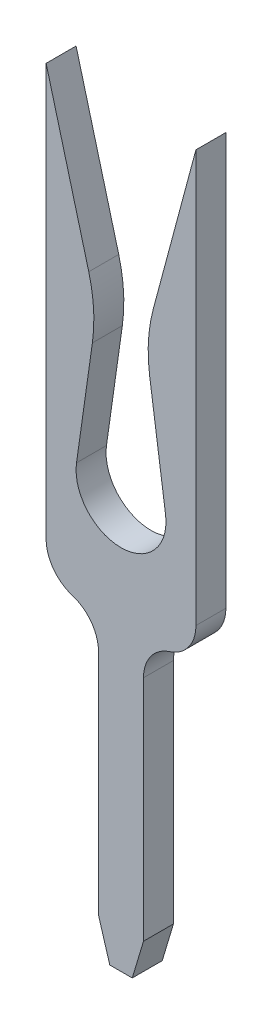
ISO-10303-21;
HEADER;
FILE_DESCRIPTION(('STEP AP214'),'2;1');
FILE_NAME('part.step','',(''),(''),'','','');
FILE_SCHEMA(('AUTOMOTIVE_DESIGN { 1 0 10303 214 1 1 1 1 }'));
ENDSEC;
DATA;
#1=APPLICATION_CONTEXT('core data for automotive mechanical design processes');
#2=APPLICATION_PROTOCOL_DEFINITION('international standard','automotive_design',2000,#1);
#3=PRODUCT_CONTEXT('',#1,'mechanical');
#4=PRODUCT('Part','Part','',(#3));
#5=PRODUCT_RELATED_PRODUCT_CATEGORY('part','',(#4));
#6=PRODUCT_DEFINITION_FORMATION('','',#4);
#7=PRODUCT_DEFINITION_CONTEXT('part definition',#1,'design');
#8=PRODUCT_DEFINITION('design','',#6,#7);
#9=PRODUCT_DEFINITION_SHAPE('','',#8);
#10=(LENGTH_UNIT() NAMED_UNIT(*) SI_UNIT(.MILLI.,.METRE.));
#11=(NAMED_UNIT(*) PLANE_ANGLE_UNIT() SI_UNIT($,.RADIAN.));
#12=(NAMED_UNIT(*) SI_UNIT($,.STERADIAN.) SOLID_ANGLE_UNIT());
#13=UNCERTAINTY_MEASURE_WITH_UNIT(LENGTH_MEASURE(1.E-05),#10,'distance_accuracy_value','');
#14=(GEOMETRIC_REPRESENTATION_CONTEXT(3) GLOBAL_UNCERTAINTY_ASSIGNED_CONTEXT((#13)) GLOBAL_UNIT_ASSIGNED_CONTEXT((#10,
#11,#12)) REPRESENTATION_CONTEXT('',''));
#15=CARTESIAN_POINT('',(0.,0.,0.));
#16=DIRECTION('',(0.,0.,1.));
#17=DIRECTION('',(1.,0.,0.));
#18=AXIS2_PLACEMENT_3D('',#15,#16,#17);
#19=CARTESIAN_POINT('',(0.,0.,0.4));
#20=DIRECTION('',(0.,0.,1.));
#21=DIRECTION('',(1.,0.,0.));
#22=AXIS2_PLACEMENT_3D('',#19,#20,#21);
#23=PLANE('',#22);
#24=DIRECTION('',(0.287347885566345,-0.957826285221151,0.));
#25=VECTOR('',#24,1.);
#26=CARTESIAN_POINT('',(-0.3,-3.5,0.4));
#27=LINE('',#26,#25);
#28=CARTESIAN_POINT('',(-0.299999999999951,-3.49999999999997,0.4));
#29=VERTEX_POINT('',#28);
#30=CARTESIAN_POINT('',(-0.15,-4.,0.4));
#31=VERTEX_POINT('',#30);
#32=EDGE_CURVE('E192',#29,#31,#27,.T.);
#33=ORIENTED_EDGE('',*,*,#32,.T.);
#34=DIRECTION('',(1.,0.,0.));
#35=VECTOR('',#34,1.);
#36=CARTESIAN_POINT('',(0.,-4.,0.4));
#37=LINE('',#36,#35);
#38=CARTESIAN_POINT('',(0.15,-4.,0.4));
#39=VERTEX_POINT('',#38);
#40=EDGE_CURVE('E182',#31,#39,#37,.T.);
#41=ORIENTED_EDGE('',*,*,#40,.T.);
#42=DIRECTION('',(0.28734788556607,0.957826285221234,0.));
#43=VECTOR('',#42,1.);
#44=CARTESIAN_POINT('',(0.15,-4.,0.4));
#45=LINE('',#44,#43);
#46=CARTESIAN_POINT('',(0.299999999999952,-3.49999999999999,0.4));
#47=VERTEX_POINT('',#46);
#48=EDGE_CURVE('E166',#47,#39,#45,.F.);
#49=ORIENTED_EDGE('',*,*,#48,.F.);
#50=DIRECTION('',(0.,1.,0.));
#51=VECTOR('',#50,1.);
#52=CARTESIAN_POINT('',(0.3,-3.5,0.4));
#53=LINE('',#52,#51);
#54=CARTESIAN_POINT('',(0.3,-0.453939201417,0.4));
#55=VERTEX_POINT('',#54);
#56=EDGE_CURVE('E143',#55,#47,#53,.F.);
#57=ORIENTED_EDGE('',*,*,#56,.F.);
#58=CARTESIAN_POINT('',(0.8,-0.453939201417,0.4));
#59=DIRECTION('',(0.,0.,1.));
#60=DIRECTION('',(1.,0.,0.));
#61=AXIS2_PLACEMENT_3D('',#58,#59,#60);
#62=CIRCLE('',#61,0.5);
#63=CARTESIAN_POINT('',(0.65,0.0230303992915,0.4));
#64=VERTEX_POINT('',#63);
#65=EDGE_CURVE('E135',#55,#64,#62,.F.);
#66=ORIENTED_EDGE('',*,*,#65,.T.);
#67=CARTESIAN_POINT('',(0.5,0.5,0.4));
#68=DIRECTION('',(0.,0.,1.));
#69=DIRECTION('',(1.,0.,0.));
#70=AXIS2_PLACEMENT_3D('',#67,#68,#69);
#71=CIRCLE('',#70,0.5);
#72=CARTESIAN_POINT('',(1.,0.5,0.4));
#73=VERTEX_POINT('',#72);
#74=EDGE_CURVE('E140',#73,#64,#71,.F.);
#75=ORIENTED_EDGE('',*,*,#74,.F.);
#76=DIRECTION('',(0.,1.,0.));
#77=VECTOR('',#76,1.);
#78=CARTESIAN_POINT('',(1.,0.5,0.4));
#79=LINE('',#78,#77);
#80=CARTESIAN_POINT('',(1.,6.,0.4));
#81=VERTEX_POINT('',#80);
#82=EDGE_CURVE('E224',#81,#73,#79,.F.);
#83=ORIENTED_EDGE('',*,*,#82,.F.);
#84=DIRECTION('',(-0.258819045102985,-0.965925826288944,0.));
#85=VECTOR('',#84,1.);
#86=CARTESIAN_POINT('',(1.,6.,0.4));
#87=LINE('',#86,#85);
#88=CARTESIAN_POINT('',(0.430598100772251,3.8749631821632,0.4));
#89=VERTEX_POINT('',#88);
#90=EDGE_CURVE('E217',#89,#81,#87,.F.);
#91=ORIENTED_EDGE('',*,*,#90,.F.);
#92=CARTESIAN_POINT('',(2.36244975335,3.35732509196,0.4));
#93=DIRECTION('',(0.,0.,1.));
#94=DIRECTION('',(1.,0.,0.));
#95=AXIS2_PLACEMENT_3D('',#92,#93,#94);
#96=CIRCLE('',#95,2.);
#97=CARTESIAN_POINT('',(0.382293985122831,3.07628571118119,0.4));
#98=VERTEX_POINT('',#97);
#99=EDGE_CURVE('E274',#98,#89,#96,.F.);
#100=ORIENTED_EDGE('',*,*,#99,.F.);
#101=DIRECTION('',(0.140519690388954,-0.990077884114675,0.));
#102=VECTOR('',#101,1.);
#103=CARTESIAN_POINT('',(0.382293985123,3.07628571118,0.4));
#104=LINE('',#103,#102);
#105=CARTESIAN_POINT('',(0.594046730468989,1.5843118142317,0.4));
#106=VERTEX_POINT('',#105);
#107=EDGE_CURVE('E212',#106,#98,#104,.F.);
#108=ORIENTED_EDGE('',*,*,#107,.F.);
#109=CARTESIAN_POINT('',(0.,1.5,0.4));
#110=DIRECTION('',(0.,0.,1.));
#111=DIRECTION('',(1.,0.,0.));
#112=AXIS2_PLACEMENT_3D('',#109,#110,#111);
#113=CIRCLE('',#112,0.6);
#114=CARTESIAN_POINT('',(-0.594046730468936,1.58431181423169,0.4));
#115=VERTEX_POINT('',#114);
#116=EDGE_CURVE('E211',#106,#115,#113,.F.);
#117=ORIENTED_EDGE('',*,*,#116,.T.);
#118=DIRECTION('',(-0.140519690388954,-0.990077884114675,0.));
#119=VECTOR('',#118,1.);
#120=CARTESIAN_POINT('',(-0.382293985123,3.07628571118,0.4));
#121=LINE('',#120,#119);
#122=CARTESIAN_POINT('',(-0.382293985121824,3.07628571118105,0.4));
#123=VERTEX_POINT('',#122);
#124=EDGE_CURVE('E208',#115,#123,#121,.F.);
#125=ORIENTED_EDGE('',*,*,#124,.T.);
#126=CARTESIAN_POINT('',(-2.36244975335,3.35732509196,0.4));
#127=DIRECTION('',(0.,0.,1.));
#128=DIRECTION('',(1.,0.,0.));
#129=AXIS2_PLACEMENT_3D('',#126,#127,#128);
#130=CIRCLE('',#129,2.);
#131=CARTESIAN_POINT('',(-0.430598100773073,3.87496318216298,0.4));
#132=VERTEX_POINT('',#131);
#133=EDGE_CURVE('E205',#132,#123,#130,.F.);
#134=ORIENTED_EDGE('',*,*,#133,.F.);
#135=DIRECTION('',(0.258819045102985,-0.965925826288944,0.));
#136=VECTOR('',#135,1.);
#137=CARTESIAN_POINT('',(-1.,6.,0.4));
#138=LINE('',#137,#136);
#139=CARTESIAN_POINT('',(-1.,6.,0.4));
#140=VERTEX_POINT('',#139);
#141=EDGE_CURVE('E202',#132,#140,#138,.F.);
#142=ORIENTED_EDGE('',*,*,#141,.T.);
#143=DIRECTION('',(0.,1.,0.));
#144=VECTOR('',#143,1.);
#145=CARTESIAN_POINT('',(-1.,0.5,0.4));
#146=LINE('',#145,#144);
#147=CARTESIAN_POINT('',(-1.,0.5,0.4));
#148=VERTEX_POINT('',#147);
#149=EDGE_CURVE('E196',#140,#148,#146,.F.);
#150=ORIENTED_EDGE('',*,*,#149,.T.);
#151=CARTESIAN_POINT('',(-0.5,0.5,0.4));
#152=DIRECTION('',(0.,0.,1.));
#153=DIRECTION('',(1.,0.,0.));
#154=AXIS2_PLACEMENT_3D('',#151,#152,#153);
#155=CIRCLE('',#154,0.5);
#156=CARTESIAN_POINT('',(-0.650000000000008,0.0230303992914753,0.4));
#157=VERTEX_POINT('',#156);
#158=EDGE_CURVE('E265',#157,#148,#155,.F.);
#159=ORIENTED_EDGE('',*,*,#158,.F.);
#160=CARTESIAN_POINT('',(-0.8,-0.453939201417,0.4));
#161=DIRECTION('',(0.,0.,1.));
#162=DIRECTION('',(1.,0.,0.));
#163=AXIS2_PLACEMENT_3D('',#160,#161,#162);
#164=CIRCLE('',#163,0.5);
#165=CARTESIAN_POINT('',(-0.3,-0.453939201417,0.4));
#166=VERTEX_POINT('',#165);
#167=EDGE_CURVE('E262',#157,#166,#164,.F.);
#168=ORIENTED_EDGE('',*,*,#167,.T.);
#169=DIRECTION('',(0.,1.,0.));
#170=VECTOR('',#169,1.);
#171=CARTESIAN_POINT('',(-0.3,-3.5,0.4));
#172=LINE('',#171,#170);
#173=EDGE_CURVE('E185',#166,#29,#172,.F.);
#174=ORIENTED_EDGE('',*,*,#173,.T.);
#175=EDGE_LOOP('',(#33,#41,#49,#57,#66,#75,#83,#91,#100,#108,#117,#125,#134,#142,#150,#159,#168,#174));
#176=FACE_BOUND('',#175,.T.);
#177=ADVANCED_FACE('F16',(#176),#23,.T.);
#178=CARTESIAN_POINT('',(0.15,-4.,0.));
#179=DIRECTION('',(0.957826285221234,-0.28734788556607,0.));
#180=DIRECTION('',(0.28734788556607,0.957826285221234,0.));
#181=AXIS2_PLACEMENT_3D('',#178,#179,#180);
#182=PLANE('',#181);
#183=DIRECTION('',(0.,0.,-1.));
#184=VECTOR('',#183,1.);
#185=CARTESIAN_POINT('',(0.3,-3.5,0.));
#186=LINE('',#185,#184);
#187=CARTESIAN_POINT('',(0.3,-3.5,0.));
#188=VERTEX_POINT('',#187);
#189=EDGE_CURVE('E164',#47,#188,#186,.T.);
#190=ORIENTED_EDGE('',*,*,#189,.F.);
#191=ORIENTED_EDGE('',*,*,#48,.T.);
#192=DIRECTION('',(0.,0.,-1.));
#193=VECTOR('',#192,1.);
#194=CARTESIAN_POINT('',(0.15,-4.,0.));
#195=LINE('',#194,#193);
#196=CARTESIAN_POINT('',(0.15,-4.,0.));
#197=VERTEX_POINT('',#196);
#198=EDGE_CURVE('E173',#197,#39,#195,.F.);
#199=ORIENTED_EDGE('',*,*,#198,.F.);
#200=DIRECTION('',(0.287347885566345,0.957826285221151,0.));
#201=VECTOR('',#200,1.);
#202=CARTESIAN_POINT('',(0.15,-4.,0.));
#203=LINE('',#202,#201);
#204=EDGE_CURVE('E169',#197,#188,#203,.T.);
#205=ORIENTED_EDGE('',*,*,#204,.T.);
#206=EDGE_LOOP('',(#190,#191,#199,#205));
#207=FACE_BOUND('',#206,.T.);
#208=ADVANCED_FACE('F529',(#207),#182,.T.);
#209=CARTESIAN_POINT('',(0.3,-3.5,0.));
#210=DIRECTION('',(1.,0.,0.));
#211=DIRECTION('',(0.,0.,-1.));
#212=AXIS2_PLACEMENT_3D('',#209,#210,#211);
#213=PLANE('',#212);
#214=DIRECTION('',(0.,0.,1.));
#215=VECTOR('',#214,1.);
#216=CARTESIAN_POINT('',(0.3,-0.453939201417,0.2));
#217=LINE('',#216,#215);
#218=CARTESIAN_POINT('',(0.3,-0.453939201417,0.));
#219=VERTEX_POINT('',#218);
#220=EDGE_CURVE('E145',#219,#55,#217,.T.);
#221=ORIENTED_EDGE('',*,*,#220,.T.);
#222=ORIENTED_EDGE('',*,*,#56,.T.);
#223=ORIENTED_EDGE('',*,*,#189,.T.);
#224=DIRECTION('',(0.,1.,0.));
#225=VECTOR('',#224,1.);
#226=CARTESIAN_POINT('',(0.3,0.,0.));
#227=LINE('',#226,#225);
#228=EDGE_CURVE('E172',#188,#219,#227,.T.);
#229=ORIENTED_EDGE('',*,*,#228,.T.);
#230=EDGE_LOOP('',(#221,#222,#223,#229));
#231=FACE_BOUND('',#230,.T.);
#232=ADVANCED_FACE('F520',(#231),#213,.T.);
#233=CARTESIAN_POINT('',(0.8,-0.453939201417,0.2));
#234=DIRECTION('',(0.,0.,1.));
#235=DIRECTION('',(1.,0.,0.));
#236=AXIS2_PLACEMENT_3D('',#233,#234,#235);
#237=CYLINDRICAL_SURFACE('',#236,0.5);
#238=CARTESIAN_POINT('',(0.8,-0.453939201417,0.));
#239=DIRECTION('',(0.,0.,1.));
#240=DIRECTION('',(1.,0.,0.));
#241=AXIS2_PLACEMENT_3D('',#238,#239,#240);
#242=CIRCLE('',#241,0.5);
#243=CARTESIAN_POINT('',(0.649999999999992,0.0230303992915248,0.));
#244=VERTEX_POINT('',#243);
#245=EDGE_CURVE('E158',#219,#244,#242,.F.);
#246=ORIENTED_EDGE('',*,*,#245,.T.);
#247=DIRECTION('',(0.,0.,1.));
#248=VECTOR('',#247,1.);
#249=CARTESIAN_POINT('',(0.649999999999992,0.0230303992915248,0.2));
#250=LINE('',#249,#248);
#251=EDGE_CURVE('E151',#64,#244,#250,.F.);
#252=ORIENTED_EDGE('',*,*,#251,.F.);
#253=ORIENTED_EDGE('',*,*,#65,.F.);
#254=ORIENTED_EDGE('',*,*,#220,.F.);
#255=EDGE_LOOP('',(#246,#252,#253,#254));
#256=FACE_BOUND('',#255,.T.);
#257=ADVANCED_FACE('F156',(#256),#237,.F.);
#258=CARTESIAN_POINT('',(0.5,0.5,0.2));
#259=DIRECTION('',(0.,0.,1.));
#260=DIRECTION('',(1.,0.,0.));
#261=AXIS2_PLACEMENT_3D('',#258,#259,#260);
#262=CYLINDRICAL_SURFACE('',#261,0.5);
#263=DIRECTION('',(0.,0.,-1.));
#264=VECTOR('',#263,1.);
#265=CARTESIAN_POINT('',(1.,0.5,0.));
#266=LINE('',#265,#264);
#267=CARTESIAN_POINT('',(1.,0.5,0.));
#268=VERTEX_POINT('',#267);
#269=EDGE_CURVE('E153',#73,#268,#266,.T.);
#270=ORIENTED_EDGE('',*,*,#269,.F.);
#271=ORIENTED_EDGE('',*,*,#74,.T.);
#272=ORIENTED_EDGE('',*,*,#251,.T.);
#273=CARTESIAN_POINT('',(0.5,0.5,0.));
#274=DIRECTION('',(0.,0.,1.));
#275=DIRECTION('',(1.,0.,0.));
#276=AXIS2_PLACEMENT_3D('',#273,#274,#275);
#277=CIRCLE('',#276,0.5);
#278=EDGE_CURVE('E258',#244,#268,#277,.T.);
#279=ORIENTED_EDGE('',*,*,#278,.T.);
#280=EDGE_LOOP('',(#270,#271,#272,#279));
#281=FACE_BOUND('',#280,.T.);
#282=ADVANCED_FACE('F149',(#281),#262,.T.);
#283=CARTESIAN_POINT('',(1.,0.5,0.));
#284=DIRECTION('',(1.,0.,0.));
#285=DIRECTION('',(0.,0.,-1.));
#286=AXIS2_PLACEMENT_3D('',#283,#284,#285);
#287=PLANE('',#286);
#288=DIRECTION('',(0.,0.,1.));
#289=VECTOR('',#288,1.);
#290=CARTESIAN_POINT('',(1.,6.,0.));
#291=LINE('',#290,#289);
#292=CARTESIAN_POINT('',(1.,6.,0.));
#293=VERTEX_POINT('',#292);
#294=EDGE_CURVE('E221',#81,#293,#291,.F.);
#295=ORIENTED_EDGE('',*,*,#294,.F.);
#296=ORIENTED_EDGE('',*,*,#82,.T.);
#297=ORIENTED_EDGE('',*,*,#269,.T.);
#298=DIRECTION('',(0.,1.,0.));
#299=VECTOR('',#298,1.);
#300=CARTESIAN_POINT('',(1.,0.,0.));
#301=LINE('',#300,#299);
#302=EDGE_CURVE('E260',#268,#293,#301,.T.);
#303=ORIENTED_EDGE('',*,*,#302,.T.);
#304=EDGE_LOOP('',(#295,#296,#297,#303));
#305=FACE_BOUND('',#304,.T.);
#306=ADVANCED_FACE('F297',(#305),#287,.T.);
#307=CARTESIAN_POINT('',(1.,6.,0.));
#308=DIRECTION('',(-0.965925826288944,0.258819045102985,0.));
#309=DIRECTION('',(-0.258819045102985,-0.965925826288944,0.));
#310=AXIS2_PLACEMENT_3D('',#307,#308,#309);
#311=PLANE('',#310);
#312=DIRECTION('',(0.,0.,1.));
#313=VECTOR('',#312,1.);
#314=CARTESIAN_POINT('',(0.430598100770746,3.87496318216087,0.2));
#315=LINE('',#314,#313);
#316=CARTESIAN_POINT('',(0.43059810077286,3.87496318216225,0.));
#317=VERTEX_POINT('',#316);
#318=EDGE_CURVE('E220',#89,#317,#315,.F.);
#319=ORIENTED_EDGE('',*,*,#318,.F.);
#320=ORIENTED_EDGE('',*,*,#90,.T.);
#321=ORIENTED_EDGE('',*,*,#294,.T.);
#322=DIRECTION('',(-0.258819045102253,-0.96592582628914,0.));
#323=VECTOR('',#322,1.);
#324=CARTESIAN_POINT('',(1.,6.,0.));
#325=LINE('',#324,#323);
#326=EDGE_CURVE('E257',#293,#317,#325,.T.);
#327=ORIENTED_EDGE('',*,*,#326,.T.);
#328=EDGE_LOOP('',(#319,#320,#321,#327));
#329=FACE_BOUND('',#328,.T.);
#330=ADVANCED_FACE('F289',(#329),#311,.T.);
#331=CARTESIAN_POINT('',(2.36244975335,3.35732509196,0.2));
#332=DIRECTION('',(0.,0.,1.));
#333=DIRECTION('',(1.,0.,0.));
#334=AXIS2_PLACEMENT_3D('',#331,#332,#333);
#335=CYLINDRICAL_SURFACE('',#334,2.);
#336=DIRECTION('',(0.,0.,1.));
#337=VECTOR('',#336,1.);
#338=CARTESIAN_POINT('',(0.382293985123,3.07628571118,0.));
#339=LINE('',#338,#337);
#340=CARTESIAN_POINT('',(0.382293985122815,3.0762857111813,0.));
#341=VERTEX_POINT('',#340);
#342=EDGE_CURVE('E216',#98,#341,#339,.F.);
#343=ORIENTED_EDGE('',*,*,#342,.F.);
#344=ORIENTED_EDGE('',*,*,#99,.T.);
#345=ORIENTED_EDGE('',*,*,#318,.T.);
#346=CARTESIAN_POINT('',(2.36244975335,3.35732509196,0.));
#347=DIRECTION('',(0.,0.,1.));
#348=DIRECTION('',(1.,0.,0.));
#349=AXIS2_PLACEMENT_3D('',#346,#347,#348);
#350=CIRCLE('',#349,2.);
#351=EDGE_CURVE('E254',#317,#341,#350,.T.);
#352=ORIENTED_EDGE('',*,*,#351,.T.);
#353=EDGE_LOOP('',(#343,#344,#345,#352));
#354=FACE_BOUND('',#353,.T.);
#355=ADVANCED_FACE('F479',(#354),#335,.T.);
#356=CARTESIAN_POINT('',(0.382293985123,3.07628571118,0.));
#357=DIRECTION('',(-0.990077884114675,-0.140519690388954,0.));
#358=DIRECTION('',(0.140519690388954,-0.990077884114675,0.));
#359=AXIS2_PLACEMENT_3D('',#356,#357,#358);
#360=PLANE('',#359);
#361=DIRECTION('',(0.,0.,1.));
#362=VECTOR('',#361,1.);
#363=CARTESIAN_POINT('',(0.594046730469278,1.58431181423004,0.2));
#364=LINE('',#363,#362);
#365=CARTESIAN_POINT('',(0.594046730468908,1.58431181423165,0.));
#366=VERTEX_POINT('',#365);
#367=EDGE_CURVE('E215',#366,#106,#364,.T.);
#368=ORIENTED_EDGE('',*,*,#367,.T.);
#369=ORIENTED_EDGE('',*,*,#107,.T.);
#370=ORIENTED_EDGE('',*,*,#342,.T.);
#371=DIRECTION('',(0.14051969038884,-0.990077884114692,0.));
#372=VECTOR('',#371,1.);
#373=CARTESIAN_POINT('',(0.382293985123,3.07628571118,0.));
#374=LINE('',#373,#372);
#375=EDGE_CURVE('E253',#341,#366,#374,.T.);
#376=ORIENTED_EDGE('',*,*,#375,.T.);
#377=EDGE_LOOP('',(#368,#369,#370,#376));
#378=FACE_BOUND('',#377,.T.);
#379=ADVANCED_FACE('F332',(#378),#360,.T.);
#380=CARTESIAN_POINT('',(0.,1.5,0.2));
#381=DIRECTION('',(0.,0.,1.));
#382=DIRECTION('',(1.,0.,0.));
#383=AXIS2_PLACEMENT_3D('',#380,#381,#382);
#384=CYLINDRICAL_SURFACE('',#383,0.6);
#385=CARTESIAN_POINT('',(0.,1.5,0.));
#386=DIRECTION('',(0.,0.,1.));
#387=DIRECTION('',(1.,0.,0.));
#388=AXIS2_PLACEMENT_3D('',#385,#386,#387);
#389=CIRCLE('',#388,0.6);
#390=CARTESIAN_POINT('',(-0.594046730468854,1.58431181423164,0.));
#391=VERTEX_POINT('',#390);
#392=EDGE_CURVE('E251',#366,#391,#389,.F.);
#393=ORIENTED_EDGE('',*,*,#392,.T.);
#394=DIRECTION('',(0.,0.,1.));
#395=VECTOR('',#394,1.);
#396=CARTESIAN_POINT('',(-0.594046730469172,1.58431181423002,0.));
#397=LINE('',#396,#395);
#398=EDGE_CURVE('E210',#391,#115,#397,.T.);
#399=ORIENTED_EDGE('',*,*,#398,.T.);
#400=ORIENTED_EDGE('',*,*,#116,.F.);
#401=ORIENTED_EDGE('',*,*,#367,.F.);
#402=EDGE_LOOP('',(#393,#399,#400,#401));
#403=FACE_BOUND('',#402,.T.);
#404=ADVANCED_FACE('F336',(#403),#384,.F.);
#405=CARTESIAN_POINT('',(-0.382293985123,3.07628571118,0.));
#406=DIRECTION('',(-0.990077884114675,0.140519690388954,0.));
#407=DIRECTION('',(-0.140519690388954,-0.990077884114675,0.));
#408=AXIS2_PLACEMENT_3D('',#405,#406,#407);
#409=PLANE('',#408);
#410=DIRECTION('',(0.14051969038884,0.990077884114692,0.));
#411=VECTOR('',#410,1.);
#412=CARTESIAN_POINT('',(-0.594046730469,1.58431181423,0.));
#413=LINE('',#412,#411);
#414=CARTESIAN_POINT('',(-0.382293985121808,3.07628571118116,0.));
#415=VERTEX_POINT('',#414);
#416=EDGE_CURVE('E250',#391,#415,#413,.T.);
#417=ORIENTED_EDGE('',*,*,#416,.T.);
#418=DIRECTION('',(0.,0.,1.));
#419=VECTOR('',#418,1.);
#420=CARTESIAN_POINT('',(-0.382293985120986,3.07628571117971,0.2));
#421=LINE('',#420,#419);
#422=EDGE_CURVE('E271',#123,#415,#421,.F.);
#423=ORIENTED_EDGE('',*,*,#422,.F.);
#424=ORIENTED_EDGE('',*,*,#124,.F.);
#425=ORIENTED_EDGE('',*,*,#398,.F.);
#426=EDGE_LOOP('',(#417,#423,#424,#425));
#427=FACE_BOUND('',#426,.T.);
#428=ADVANCED_FACE('F378',(#427),#409,.F.);
#429=CARTESIAN_POINT('',(-2.36244975335,3.35732509196,0.2));
#430=DIRECTION('',(0.,0.,1.));
#431=DIRECTION('',(1.,0.,0.));
#432=AXIS2_PLACEMENT_3D('',#429,#430,#431);
#433=CYLINDRICAL_SURFACE('',#432,2.);
#434=DIRECTION('',(0.,0.,1.));
#435=VECTOR('',#434,1.);
#436=CARTESIAN_POINT('',(-0.43059810077239,3.87496318216043,0.));
#437=LINE('',#436,#435);
#438=CARTESIAN_POINT('',(-0.430598100773682,3.87496318216203,0.));
#439=VERTEX_POINT('',#438);
#440=EDGE_CURVE('E199',#439,#132,#437,.T.);
#441=ORIENTED_EDGE('',*,*,#440,.T.);
#442=ORIENTED_EDGE('',*,*,#133,.T.);
#443=ORIENTED_EDGE('',*,*,#422,.T.);
#444=CARTESIAN_POINT('',(-2.36244975335,3.35732509196,0.));
#445=DIRECTION('',(0.,0.,1.));
#446=DIRECTION('',(1.,0.,0.));
#447=AXIS2_PLACEMENT_3D('',#444,#445,#446);
#448=CIRCLE('',#447,2.);
#449=EDGE_CURVE('E246',#415,#439,#448,.T.);
#450=ORIENTED_EDGE('',*,*,#449,.T.);
#451=EDGE_LOOP('',(#441,#442,#443,#450));
#452=FACE_BOUND('',#451,.T.);
#453=ADVANCED_FACE('F377',(#452),#433,.T.);
#454=CARTESIAN_POINT('',(-1.,6.,0.));
#455=DIRECTION('',(-0.965925826288944,-0.258819045102985,0.));
#456=DIRECTION('',(0.258819045102985,-0.965925826288944,0.));
#457=AXIS2_PLACEMENT_3D('',#454,#455,#456);
#458=PLANE('',#457);
#459=DIRECTION('',(-0.258819045102253,0.96592582628914,0.));
#460=VECTOR('',#459,1.);
#461=CARTESIAN_POINT('',(-0.430598100774,3.87496318216,0.));
#462=LINE('',#461,#460);
#463=CARTESIAN_POINT('',(-1.,6.,0.));
#464=VERTEX_POINT('',#463);
#465=EDGE_CURVE('E249',#439,#464,#462,.T.);
#466=ORIENTED_EDGE('',*,*,#465,.T.);
#467=DIRECTION('',(0.,0.,-1.));
#468=VECTOR('',#467,1.);
#469=CARTESIAN_POINT('',(-1.,6.,0.));
#470=LINE('',#469,#468);
#471=EDGE_CURVE('E198',#464,#140,#470,.F.);
#472=ORIENTED_EDGE('',*,*,#471,.T.);
#473=ORIENTED_EDGE('',*,*,#141,.F.);
#474=ORIENTED_EDGE('',*,*,#440,.F.);
#475=EDGE_LOOP('',(#466,#472,#473,#474));
#476=FACE_BOUND('',#475,.T.);
#477=ADVANCED_FACE('F374',(#476),#458,.F.);
#478=CARTESIAN_POINT('',(-1.,0.5,0.));
#479=DIRECTION('',(1.,0.,0.));
#480=DIRECTION('',(0.,0.,-1.));
#481=AXIS2_PLACEMENT_3D('',#478,#479,#480);
#482=PLANE('',#481);
#483=DIRECTION('',(0.,1.,0.));
#484=VECTOR('',#483,1.);
#485=CARTESIAN_POINT('',(-1.,0.,0.));
#486=LINE('',#485,#484);
#487=CARTESIAN_POINT('',(-1.,0.5,0.));
#488=VERTEX_POINT('',#487);
#489=EDGE_CURVE('E245',#464,#488,#486,.F.);
#490=ORIENTED_EDGE('',*,*,#489,.T.);
#491=DIRECTION('',(0.,0.,1.));
#492=VECTOR('',#491,1.);
#493=CARTESIAN_POINT('',(-1.,0.5,0.2));
#494=LINE('',#493,#492);
#495=EDGE_CURVE('E268',#148,#488,#494,.F.);
#496=ORIENTED_EDGE('',*,*,#495,.F.);
#497=ORIENTED_EDGE('',*,*,#149,.F.);
#498=ORIENTED_EDGE('',*,*,#471,.F.);
#499=EDGE_LOOP('',(#490,#496,#497,#498));
#500=FACE_BOUND('',#499,.T.);
#501=ADVANCED_FACE('F372',(#500),#482,.F.);
#502=CARTESIAN_POINT('',(-0.5,0.5,0.2));
#503=DIRECTION('',(0.,0.,1.));
#504=DIRECTION('',(1.,0.,0.));
#505=AXIS2_PLACEMENT_3D('',#502,#503,#504);
#506=CYLINDRICAL_SURFACE('',#505,0.5);
#507=DIRECTION('',(0.,0.,1.));
#508=VECTOR('',#507,1.);
#509=CARTESIAN_POINT('',(-0.650000000000008,0.0230303992914753,0.2));
#510=LINE('',#509,#508);
#511=CARTESIAN_POINT('',(-0.650000000000008,0.0230303992914753,0.));
#512=VERTEX_POINT('',#511);
#513=EDGE_CURVE('E189',#512,#157,#510,.T.);
#514=ORIENTED_EDGE('',*,*,#513,.T.);
#515=ORIENTED_EDGE('',*,*,#158,.T.);
#516=ORIENTED_EDGE('',*,*,#495,.T.);
#517=CARTESIAN_POINT('',(-0.5,0.5,0.));
#518=DIRECTION('',(0.,0.,1.));
#519=DIRECTION('',(1.,0.,0.));
#520=AXIS2_PLACEMENT_3D('',#517,#518,#519);
#521=CIRCLE('',#520,0.5);
#522=EDGE_CURVE('E242',#488,#512,#521,.T.);
#523=ORIENTED_EDGE('',*,*,#522,.T.);
#524=EDGE_LOOP('',(#514,#515,#516,#523));
#525=FACE_BOUND('',#524,.T.);
#526=ADVANCED_FACE('F368',(#525),#506,.T.);
#527=CARTESIAN_POINT('',(-0.8,-0.453939201417,0.2));
#528=DIRECTION('',(0.,0.,1.));
#529=DIRECTION('',(1.,0.,0.));
#530=AXIS2_PLACEMENT_3D('',#527,#528,#529);
#531=CYLINDRICAL_SURFACE('',#530,0.5);
#532=CARTESIAN_POINT('',(-0.8,-0.453939201417,0.));
#533=DIRECTION('',(0.,0.,1.));
#534=DIRECTION('',(1.,0.,0.));
#535=AXIS2_PLACEMENT_3D('',#532,#533,#534);
#536=CIRCLE('',#535,0.5);
#537=CARTESIAN_POINT('',(-0.3,-0.453939201417,0.));
#538=VERTEX_POINT('',#537);
#539=EDGE_CURVE('E238',#512,#538,#536,.F.);
#540=ORIENTED_EDGE('',*,*,#539,.T.);
#541=DIRECTION('',(0.,0.,-1.));
#542=VECTOR('',#541,1.);
#543=CARTESIAN_POINT('',(-0.3,-0.453939201417,0.));
#544=LINE('',#543,#542);
#545=EDGE_CURVE('E188',#538,#166,#544,.F.);
#546=ORIENTED_EDGE('',*,*,#545,.T.);
#547=ORIENTED_EDGE('',*,*,#167,.F.);
#548=ORIENTED_EDGE('',*,*,#513,.F.);
#549=EDGE_LOOP('',(#540,#546,#547,#548));
#550=FACE_BOUND('',#549,.T.);
#551=ADVANCED_FACE('F365',(#550),#531,.F.);
#552=CARTESIAN_POINT('',(-0.3,-3.5,0.));
#553=DIRECTION('',(1.,0.,0.));
#554=DIRECTION('',(0.,0.,-1.));
#555=AXIS2_PLACEMENT_3D('',#552,#553,#554);
#556=PLANE('',#555);
#557=DIRECTION('',(0.,1.,0.));
#558=VECTOR('',#557,1.);
#559=CARTESIAN_POINT('',(-0.3,0.,0.));
#560=LINE('',#559,#558);
#561=CARTESIAN_POINT('',(-0.299999999999951,-3.49999999999999,0.));
#562=VERTEX_POINT('',#561);
#563=EDGE_CURVE('E241',#538,#562,#560,.F.);
#564=ORIENTED_EDGE('',*,*,#563,.T.);
#565=DIRECTION('',(0.,0.,1.));
#566=VECTOR('',#565,1.);
#567=CARTESIAN_POINT('',(-0.299999999999856,-3.49999999999996,0.));
#568=LINE('',#567,#566);
#569=EDGE_CURVE('E235',#562,#29,#568,.T.);
#570=ORIENTED_EDGE('',*,*,#569,.T.);
#571=ORIENTED_EDGE('',*,*,#173,.F.);
#572=ORIENTED_EDGE('',*,*,#545,.F.);
#573=EDGE_LOOP('',(#564,#570,#571,#572));
#574=FACE_BOUND('',#573,.T.);
#575=ADVANCED_FACE('F360',(#574),#556,.F.);
#576=CARTESIAN_POINT('',(-0.15,-4.,0.));
#577=DIRECTION('',(0.957826285221234,0.28734788556607,0.));
#578=DIRECTION('',(-0.28734788556607,0.957826285221234,0.));
#579=AXIS2_PLACEMENT_3D('',#576,#577,#578);
#580=PLANE('',#579);
#581=DIRECTION('',(0.287347885566345,-0.957826285221151,0.));
#582=VECTOR('',#581,1.);
#583=CARTESIAN_POINT('',(-0.3,-3.5,0.));
#584=LINE('',#583,#582);
#585=CARTESIAN_POINT('',(-0.15,-4.,0.));
#586=VERTEX_POINT('',#585);
#587=EDGE_CURVE('E25',#562,#586,#584,.T.);
#588=ORIENTED_EDGE('',*,*,#587,.T.);
#589=DIRECTION('',(0.,0.,-1.));
#590=VECTOR('',#589,1.);
#591=CARTESIAN_POINT('',(-0.15,-4.,0.));
#592=LINE('',#591,#590);
#593=EDGE_CURVE('E32',#31,#586,#592,.T.);
#594=ORIENTED_EDGE('',*,*,#593,.F.);
#595=ORIENTED_EDGE('',*,*,#32,.F.);
#596=ORIENTED_EDGE('',*,*,#569,.F.);
#597=EDGE_LOOP('',(#588,#594,#595,#596));
#598=FACE_BOUND('',#597,.T.);
#599=ADVANCED_FACE('F380',(#598),#580,.F.);
#600=CARTESIAN_POINT('',(-0.15,-4.,0.));
#601=DIRECTION('',(0.,-1.,0.));
#602=DIRECTION('',(0.,0.,-1.));
#603=AXIS2_PLACEMENT_3D('',#600,#601,#602);
#604=PLANE('',#603);
#605=ORIENTED_EDGE('',*,*,#198,.T.);
#606=ORIENTED_EDGE('',*,*,#40,.F.);
#607=ORIENTED_EDGE('',*,*,#593,.T.);
#608=DIRECTION('',(1.,0.,0.));
#609=VECTOR('',#608,1.);
#610=CARTESIAN_POINT('',(0.,-4.,0.));
#611=LINE('',#610,#609);
#612=EDGE_CURVE('E11',#586,#197,#611,.T.);
#613=ORIENTED_EDGE('',*,*,#612,.T.);
#614=EDGE_LOOP('',(#605,#606,#607,#613));
#615=FACE_BOUND('',#614,.T.);
#616=ADVANCED_FACE('F382',(#615),#604,.T.);
#617=CARTESIAN_POINT('',(0.,0.,0.));
#618=DIRECTION('',(0.,0.,1.));
#619=DIRECTION('',(1.,0.,0.));
#620=AXIS2_PLACEMENT_3D('',#617,#618,#619);
#621=PLANE('',#620);
#622=ORIENTED_EDGE('',*,*,#612,.F.);
#623=ORIENTED_EDGE('',*,*,#587,.F.);
#624=ORIENTED_EDGE('',*,*,#563,.F.);
#625=ORIENTED_EDGE('',*,*,#539,.F.);
#626=ORIENTED_EDGE('',*,*,#522,.F.);
#627=ORIENTED_EDGE('',*,*,#489,.F.);
#628=ORIENTED_EDGE('',*,*,#465,.F.);
#629=ORIENTED_EDGE('',*,*,#449,.F.);
#630=ORIENTED_EDGE('',*,*,#416,.F.);
#631=ORIENTED_EDGE('',*,*,#392,.F.);
#632=ORIENTED_EDGE('',*,*,#375,.F.);
#633=ORIENTED_EDGE('',*,*,#351,.F.);
#634=ORIENTED_EDGE('',*,*,#326,.F.);
#635=ORIENTED_EDGE('',*,*,#302,.F.);
#636=ORIENTED_EDGE('',*,*,#278,.F.);
#637=ORIENTED_EDGE('',*,*,#245,.F.);
#638=ORIENTED_EDGE('',*,*,#228,.F.);
#639=ORIENTED_EDGE('',*,*,#204,.F.);
#640=EDGE_LOOP('',(#622,#623,#624,#625,#626,#627,#628,#629,#630,#631,#632,#633,#634,#635,#636,
#637,#638,#639));
#641=FACE_BOUND('',#640,.T.);
#642=ADVANCED_FACE('F294',(#641),#621,.F.);
#643=CLOSED_SHELL('',(#177,#208,#232,#257,#282,#306,#330,#355,#379,#404,#428,#453,#477,#501,
#526,#551,#575,#599,#616,#642));
#644=MANIFOLD_SOLID_BREP('B1',#643);
#645=ADVANCED_BREP_SHAPE_REPRESENTATION('',(#18,#644),#14);
#646=SHAPE_DEFINITION_REPRESENTATION(#9,#645);
ENDSEC;
END-ISO-10303-21;
